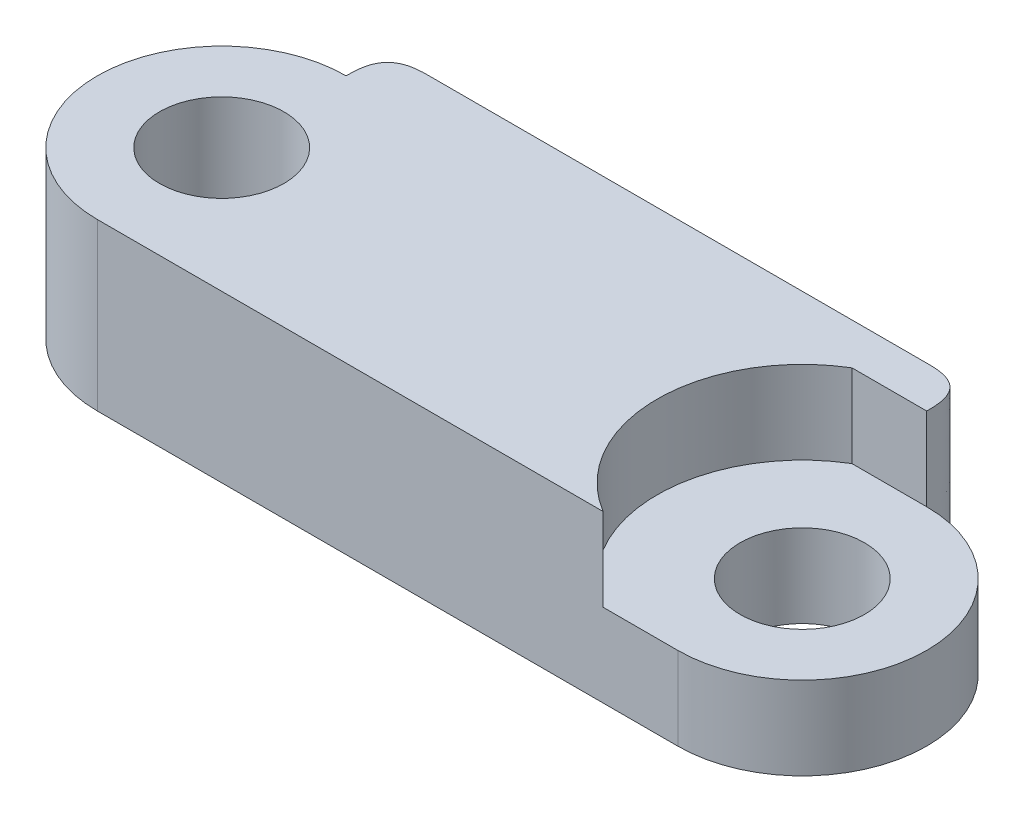
ISO-10303-21;
HEADER;
FILE_DESCRIPTION(('STEP AP214'),'2;1');
FILE_NAME('part.step','',(''),(''),'','','');
FILE_SCHEMA(('AUTOMOTIVE_DESIGN { 1 0 10303 214 1 1 1 1 }'));
ENDSEC;
DATA;
#1=APPLICATION_CONTEXT('core data for automotive mechanical design processes');
#2=APPLICATION_PROTOCOL_DEFINITION('international standard','automotive_design',2000,#1);
#3=PRODUCT_CONTEXT('',#1,'mechanical');
#4=PRODUCT('Part','Part','',(#3));
#5=PRODUCT_RELATED_PRODUCT_CATEGORY('part','',(#4));
#6=PRODUCT_DEFINITION_FORMATION('','',#4);
#7=PRODUCT_DEFINITION_CONTEXT('part definition',#1,'design');
#8=PRODUCT_DEFINITION('design','',#6,#7);
#9=PRODUCT_DEFINITION_SHAPE('','',#8);
#10=(LENGTH_UNIT() NAMED_UNIT(*) SI_UNIT(.MILLI.,.METRE.));
#11=(NAMED_UNIT(*) PLANE_ANGLE_UNIT() SI_UNIT($,.RADIAN.));
#12=(NAMED_UNIT(*) SI_UNIT($,.STERADIAN.) SOLID_ANGLE_UNIT());
#13=UNCERTAINTY_MEASURE_WITH_UNIT(LENGTH_MEASURE(1.E-05),#10,'distance_accuracy_value','');
#14=(GEOMETRIC_REPRESENTATION_CONTEXT(3) GLOBAL_UNCERTAINTY_ASSIGNED_CONTEXT((#13)) GLOBAL_UNIT_ASSIGNED_CONTEXT((#10,
#11,#12)) REPRESENTATION_CONTEXT('',''));
#15=CARTESIAN_POINT('',(0.,0.,0.));
#16=DIRECTION('',(0.,0.,1.));
#17=DIRECTION('',(1.,0.,0.));
#18=AXIS2_PLACEMENT_3D('',#15,#16,#17);
#19=CARTESIAN_POINT('',(-7.,2.,0.));
#20=DIRECTION('',(0.,1.,0.));
#21=DIRECTION('',(0.,0.,1.));
#22=AXIS2_PLACEMENT_3D('',#19,#20,#21);
#23=PLANE('',#22);
#24=DIRECTION('',(-1.,0.,0.));
#25=VECTOR('',#24,1.);
#26=CARTESIAN_POINT('',(-7.,2.,-3.));
#27=LINE('',#26,#25);
#28=CARTESIAN_POINT('',(7.,2.,-3.));
#29=VERTEX_POINT('',#28);
#30=CARTESIAN_POINT('',(5.19722436226801,2.,-3.));
#31=VERTEX_POINT('',#30);
#32=EDGE_CURVE('E202',#29,#31,#27,.T.);
#33=ORIENTED_EDGE('',*,*,#32,.F.);
#34=CARTESIAN_POINT('',(6.,2.,-4.));
#35=CARTESIAN_POINT('',(6.16819805153395,2.,-4.));
#36=CARTESIAN_POINT('',(6.3363961030679,2.,-4.));
#37=CARTESIAN_POINT('',(6.70710678118655,2.,-3.92830808016392));
#38=CARTESIAN_POINT('',(6.92830808016392,2.,-3.70710678118655));
#39=CARTESIAN_POINT('',(7.,2.,-3.33639610306789));
#40=CARTESIAN_POINT('',(7.,2.,-3.16819805153395));
#41=CARTESIAN_POINT('',(7.,2.,-3.));
#42=B_SPLINE_CURVE_WITH_KNOTS('',5,(#34,#35,#36,#37,#38,#39,#40,#41),.UNSPECIFIED.,.F.,.F.,(6,2,
6),(0.,0.5,1.),.UNSPECIFIED.);
#43=CARTESIAN_POINT('',(6.,2.,-4.));
#44=VERTEX_POINT('',#43);
#45=EDGE_CURVE('E11',#29,#44,#42,.F.);
#46=ORIENTED_EDGE('',*,*,#45,.T.);
#47=DIRECTION('',(1.,0.,0.));
#48=VECTOR('',#47,1.);
#49=CARTESIAN_POINT('',(7.,2.,-4.));
#50=LINE('',#49,#48);
#51=CARTESIAN_POINT('',(-6.,2.,-4.));
#52=VERTEX_POINT('',#51);
#53=EDGE_CURVE('E199',#52,#44,#50,.T.);
#54=ORIENTED_EDGE('',*,*,#53,.F.);
#55=CARTESIAN_POINT('',(-7.,2.,-3.));
#56=CARTESIAN_POINT('',(-7.,2.,-3.16819805153395));
#57=CARTESIAN_POINT('',(-7.,2.,-3.33639610306789));
#58=CARTESIAN_POINT('',(-6.92830808016392,2.,-3.70710678118655));
#59=CARTESIAN_POINT('',(-6.70710678118655,2.,-3.92830808016392));
#60=CARTESIAN_POINT('',(-6.3363961030679,2.,-4.));
#61=CARTESIAN_POINT('',(-6.16819805153395,2.,-4.));
#62=CARTESIAN_POINT('',(-6.,2.,-4.));
#63=B_SPLINE_CURVE_WITH_KNOTS('',5,(#55,#56,#57,#58,#59,#60,#61,#62),.UNSPECIFIED.,.F.,.F.,(6,2,
6),(0.,0.5,1.),.UNSPECIFIED.);
#64=CARTESIAN_POINT('',(-7.,2.,-3.));
#65=VERTEX_POINT('',#64);
#66=EDGE_CURVE('E56',#52,#65,#63,.F.);
#67=ORIENTED_EDGE('',*,*,#66,.T.);
#68=CARTESIAN_POINT('',(-7.,2.,0.));
#69=DIRECTION('',(0.,1.,0.));
#70=DIRECTION('',(0.,0.,1.));
#71=AXIS2_PLACEMENT_3D('',#68,#69,#70);
#72=CIRCLE('',#71,3.);
#73=CARTESIAN_POINT('',(-7.,2.,3.));
#74=VERTEX_POINT('',#73);
#75=EDGE_CURVE('E135',#65,#74,#72,.T.);
#76=ORIENTED_EDGE('',*,*,#75,.T.);
#77=DIRECTION('',(1.,0.,0.));
#78=VECTOR('',#77,1.);
#79=CARTESIAN_POINT('',(-7.,2.,3.));
#80=LINE('',#79,#78);
#81=CARTESIAN_POINT('',(5.19722436226801,2.,3.));
#82=VERTEX_POINT('',#81);
#83=EDGE_CURVE('E245',#74,#82,#80,.T.);
#84=ORIENTED_EDGE('',*,*,#83,.T.);
#85=CARTESIAN_POINT('',(7.,2.,0.));
#86=DIRECTION('',(0.,1.,0.));
#87=DIRECTION('',(0.,0.,-1.));
#88=AXIS2_PLACEMENT_3D('',#85,#86,#87);
#89=CIRCLE('',#88,3.5);
#90=EDGE_CURVE('E224',#31,#82,#89,.T.);
#91=ORIENTED_EDGE('',*,*,#90,.F.);
#92=EDGE_LOOP('',(#33,#46,#54,#67,#76,#84,#91));
#93=FACE_BOUND('',#92,.T.);
#94=CARTESIAN_POINT('',(-7.,2.,0.));
#95=DIRECTION('',(0.,1.,0.));
#96=DIRECTION('',(0.,0.,1.));
#97=AXIS2_PLACEMENT_3D('',#94,#95,#96);
#98=CIRCLE('',#97,1.5);
#99=CARTESIAN_POINT('',(-7.,2.,1.5));
#100=VERTEX_POINT('',#99);
#101=EDGE_CURVE('E239',#100,#100,#98,.T.);
#102=ORIENTED_EDGE('',*,*,#101,.F.);
#103=EDGE_LOOP('',(#102));
#104=FACE_BOUND('',#103,.T.);
#105=ADVANCED_FACE('F41',(#93,#104),#23,.T.);
#106=CARTESIAN_POINT('',(-7.,-2.,0.));
#107=DIRECTION('',(0.,1.,0.));
#108=DIRECTION('',(0.,0.,1.));
#109=AXIS2_PLACEMENT_3D('',#106,#107,#108);
#110=PLANE('',#109);
#111=DIRECTION('',(1.,0.,0.));
#112=VECTOR('',#111,1.);
#113=CARTESIAN_POINT('',(7.,-2.,-4.));
#114=LINE('',#113,#112);
#115=CARTESIAN_POINT('',(-6.,-2.,-4.));
#116=VERTEX_POINT('',#115);
#117=CARTESIAN_POINT('',(6.,-2.,-4.));
#118=VERTEX_POINT('',#117);
#119=EDGE_CURVE('E122',#116,#118,#114,.T.);
#120=ORIENTED_EDGE('',*,*,#119,.T.);
#121=CARTESIAN_POINT('',(7.,-2.,-3.));
#122=CARTESIAN_POINT('',(7.,-2.,-3.16819805153395));
#123=CARTESIAN_POINT('',(7.,-2.,-3.33639610306789));
#124=CARTESIAN_POINT('',(6.92830808016392,-2.,-3.70710678118655));
#125=CARTESIAN_POINT('',(6.70710678118655,-2.,-3.92830808016392));
#126=CARTESIAN_POINT('',(6.3363961030679,-2.,-4.));
#127=CARTESIAN_POINT('',(6.16819805153395,-2.,-4.));
#128=CARTESIAN_POINT('',(6.,-2.,-4.));
#129=B_SPLINE_CURVE_WITH_KNOTS('',5,(#121,#122,#123,#124,#125,#126,#127,#128),.UNSPECIFIED.,.F.,
.F.,(6,2,6),(0.,0.5,1.),.UNSPECIFIED.);
#130=CARTESIAN_POINT('',(7.,-2.,-3.));
#131=VERTEX_POINT('',#130);
#132=EDGE_CURVE('E63',#118,#131,#129,.F.);
#133=ORIENTED_EDGE('',*,*,#132,.T.);
#134=CARTESIAN_POINT('',(7.,-2.,0.));
#135=DIRECTION('',(0.,1.,0.));
#136=DIRECTION('',(0.,0.,1.));
#137=AXIS2_PLACEMENT_3D('',#134,#135,#136);
#138=CIRCLE('',#137,3.);
#139=CARTESIAN_POINT('',(7.,-2.,3.));
#140=VERTEX_POINT('',#139);
#141=EDGE_CURVE('E121',#140,#131,#138,.T.);
#142=ORIENTED_EDGE('',*,*,#141,.F.);
#143=DIRECTION('',(1.,0.,0.));
#144=VECTOR('',#143,1.);
#145=CARTESIAN_POINT('',(-7.,-2.,3.));
#146=LINE('',#145,#144);
#147=CARTESIAN_POINT('',(-7.,-2.,3.));
#148=VERTEX_POINT('',#147);
#149=EDGE_CURVE('E136',#148,#140,#146,.T.);
#150=ORIENTED_EDGE('',*,*,#149,.F.);
#151=CARTESIAN_POINT('',(-7.,-2.,0.));
#152=DIRECTION('',(0.,1.,0.));
#153=DIRECTION('',(0.,0.,1.));
#154=AXIS2_PLACEMENT_3D('',#151,#152,#153);
#155=CIRCLE('',#154,3.);
#156=CARTESIAN_POINT('',(-7.,-2.,-3.));
#157=VERTEX_POINT('',#156);
#158=EDGE_CURVE('E242',#157,#148,#155,.T.);
#159=ORIENTED_EDGE('',*,*,#158,.F.);
#160=CARTESIAN_POINT('',(-6.,-2.,-4.));
#161=CARTESIAN_POINT('',(-6.16819805153395,-2.,-4.));
#162=CARTESIAN_POINT('',(-6.3363961030679,-2.,-4.));
#163=CARTESIAN_POINT('',(-6.70710678118655,-2.,-3.92830808016392));
#164=CARTESIAN_POINT('',(-6.92830808016392,-2.,-3.70710678118655));
#165=CARTESIAN_POINT('',(-7.,-2.,-3.33639610306789));
#166=CARTESIAN_POINT('',(-7.,-2.,-3.16819805153395));
#167=CARTESIAN_POINT('',(-7.,-2.,-3.));
#168=B_SPLINE_CURVE_WITH_KNOTS('',5,(#160,#161,#162,#163,#164,#165,#166,#167),.UNSPECIFIED.,.F.,
.F.,(6,2,6),(0.,0.5,1.),.UNSPECIFIED.);
#169=EDGE_CURVE('E72',#157,#116,#168,.F.);
#170=ORIENTED_EDGE('',*,*,#169,.T.);
#171=EDGE_LOOP('',(#120,#133,#142,#150,#159,#170));
#172=FACE_BOUND('',#171,.T.);
#173=CARTESIAN_POINT('',(-7.,-2.,0.));
#174=DIRECTION('',(0.,1.,0.));
#175=DIRECTION('',(0.,0.,1.));
#176=AXIS2_PLACEMENT_3D('',#173,#174,#175);
#177=CIRCLE('',#176,1.5);
#178=CARTESIAN_POINT('',(-7.,-2.,1.5));
#179=VERTEX_POINT('',#178);
#180=EDGE_CURVE('E238',#179,#179,#177,.T.);
#181=ORIENTED_EDGE('',*,*,#180,.T.);
#182=EDGE_LOOP('',(#181));
#183=FACE_BOUND('',#182,.T.);
#184=CARTESIAN_POINT('',(7.,-2.,0.));
#185=DIRECTION('',(0.,1.,0.));
#186=DIRECTION('',(0.,0.,1.));
#187=AXIS2_PLACEMENT_3D('',#184,#185,#186);
#188=CIRCLE('',#187,1.5);
#189=CARTESIAN_POINT('',(7.,-2.,1.5));
#190=VERTEX_POINT('',#189);
#191=EDGE_CURVE('E235',#190,#190,#188,.T.);
#192=ORIENTED_EDGE('',*,*,#191,.T.);
#193=EDGE_LOOP('',(#192));
#194=FACE_BOUND('',#193,.T.);
#195=ADVANCED_FACE('F119',(#172,#183,#194),#110,.F.);
#196=CARTESIAN_POINT('',(-7.,2.,0.));
#197=DIRECTION('',(0.,-1.,0.));
#198=DIRECTION('',(0.,0.,-1.));
#199=AXIS2_PLACEMENT_3D('',#196,#197,#198);
#200=CYLINDRICAL_SURFACE('',#199,3.);
#201=ORIENTED_EDGE('',*,*,#158,.T.);
#202=DIRECTION('',(0.,-1.,0.));
#203=VECTOR('',#202,1.);
#204=CARTESIAN_POINT('',(-7.,2.,3.));
#205=LINE('',#204,#203);
#206=EDGE_CURVE('E249',#74,#148,#205,.T.);
#207=ORIENTED_EDGE('',*,*,#206,.F.);
#208=ORIENTED_EDGE('',*,*,#75,.F.);
#209=CARTESIAN_POINT('',(-7.,-2.2,-3.));
#210=CARTESIAN_POINT('',(-7.,-0.733333333333336,-3.));
#211=CARTESIAN_POINT('',(-7.,0.733333333333336,-3.));
#212=CARTESIAN_POINT('',(-7.,2.2,-3.));
#213=B_SPLINE_CURVE_WITH_KNOTS('',3,(#209,#210,#211,#212),.UNSPECIFIED.,.F.,.F.,(4,4),
(0.0138356688476182,0.0182356688476182),.UNSPECIFIED.);
#214=EDGE_CURVE('E144',#65,#157,#213,.F.);
#215=ORIENTED_EDGE('',*,*,#214,.T.);
#216=EDGE_LOOP('',(#201,#207,#208,#215));
#217=FACE_BOUND('',#216,.T.);
#218=ADVANCED_FACE('F165',(#217),#200,.T.);
#219=CARTESIAN_POINT('',(-7.,2.,3.));
#220=DIRECTION('',(0.,0.,-1.));
#221=DIRECTION('',(-1.,0.,0.));
#222=AXIS2_PLACEMENT_3D('',#219,#220,#221);
#223=PLANE('',#222);
#224=DIRECTION('',(1.,0.,0.));
#225=VECTOR('',#224,1.);
#226=CARTESIAN_POINT('',(7.,0.,3.));
#227=LINE('',#226,#225);
#228=CARTESIAN_POINT('',(5.19722436226801,0.,3.));
#229=VERTEX_POINT('',#228);
#230=CARTESIAN_POINT('',(7.,0.,3.));
#231=VERTEX_POINT('',#230);
#232=EDGE_CURVE('E223',#229,#231,#227,.T.);
#233=ORIENTED_EDGE('',*,*,#232,.F.);
#234=DIRECTION('',(0.,1.,0.));
#235=VECTOR('',#234,1.);
#236=CARTESIAN_POINT('',(5.19722436226801,0.,3.));
#237=LINE('',#236,#235);
#238=EDGE_CURVE('E231',#229,#82,#237,.T.);
#239=ORIENTED_EDGE('',*,*,#238,.T.);
#240=ORIENTED_EDGE('',*,*,#83,.F.);
#241=ORIENTED_EDGE('',*,*,#206,.T.);
#242=ORIENTED_EDGE('',*,*,#149,.T.);
#243=DIRECTION('',(0.,-1.,0.));
#244=VECTOR('',#243,1.);
#245=CARTESIAN_POINT('',(7.,2.,3.));
#246=LINE('',#245,#244);
#247=EDGE_CURVE('E133',#231,#140,#246,.T.);
#248=ORIENTED_EDGE('',*,*,#247,.F.);
#249=EDGE_LOOP('',(#233,#239,#240,#241,#242,#248));
#250=FACE_BOUND('',#249,.T.);
#251=ADVANCED_FACE('F255',(#250),#223,.F.);
#252=CARTESIAN_POINT('',(7.,2.,0.));
#253=DIRECTION('',(0.,-1.,0.));
#254=DIRECTION('',(0.,0.,-1.));
#255=AXIS2_PLACEMENT_3D('',#252,#253,#254);
#256=CYLINDRICAL_SURFACE('',#255,3.);
#257=CARTESIAN_POINT('',(7.,2.2,-3.));
#258=CARTESIAN_POINT('',(7.,0.733333333333334,-3.));
#259=CARTESIAN_POINT('',(7.,-0.73333333333334,-3.));
#260=CARTESIAN_POINT('',(7.,-2.20000000000001,-3.));
#261=B_SPLINE_CURVE_WITH_KNOTS('',3,(#257,#258,#259,#260),.UNSPECIFIED.,.F.,.F.,(4,4),
(0.0138356688476182,0.0182356688476182),.UNSPECIFIED.);
#262=CARTESIAN_POINT('',(7.,0.,-3.));
#263=VERTEX_POINT('',#262);
#264=EDGE_CURVE('E129',#263,#131,#261,.T.);
#265=ORIENTED_EDGE('',*,*,#264,.F.);
#266=CARTESIAN_POINT('',(7.,0.,0.));
#267=DIRECTION('',(0.,1.,0.));
#268=DIRECTION('',(0.,0.,-1.));
#269=AXIS2_PLACEMENT_3D('',#266,#267,#268);
#270=CIRCLE('',#269,3.);
#271=EDGE_CURVE('E226',#231,#263,#270,.T.);
#272=ORIENTED_EDGE('',*,*,#271,.F.);
#273=ORIENTED_EDGE('',*,*,#247,.T.);
#274=ORIENTED_EDGE('',*,*,#141,.T.);
#275=EDGE_LOOP('',(#265,#272,#273,#274));
#276=FACE_BOUND('',#275,.T.);
#277=ADVANCED_FACE('F127',(#276),#256,.T.);
#278=CARTESIAN_POINT('',(-7.,2.,0.));
#279=DIRECTION('',(0.,-1.,0.));
#280=DIRECTION('',(0.,0.,-1.));
#281=AXIS2_PLACEMENT_3D('',#278,#279,#280);
#282=CYLINDRICAL_SURFACE('',#281,1.5);
#283=ORIENTED_EDGE('',*,*,#101,.T.);
#284=EDGE_LOOP('',(#283));
#285=FACE_BOUND('',#284,.T.);
#286=ORIENTED_EDGE('',*,*,#180,.F.);
#287=EDGE_LOOP('',(#286));
#288=FACE_BOUND('',#287,.T.);
#289=ADVANCED_FACE('F383',(#285,#288),#282,.F.);
#290=CARTESIAN_POINT('',(7.,2.,0.));
#291=DIRECTION('',(0.,-1.,0.));
#292=DIRECTION('',(0.,0.,-1.));
#293=AXIS2_PLACEMENT_3D('',#290,#291,#292);
#294=CYLINDRICAL_SURFACE('',#293,1.5);
#295=CARTESIAN_POINT('',(7.,0.,0.));
#296=DIRECTION('',(0.,-1.,0.));
#297=DIRECTION('',(0.,0.,-1.));
#298=AXIS2_PLACEMENT_3D('',#295,#296,#297);
#299=CIRCLE('',#298,1.5);
#300=CARTESIAN_POINT('',(7.,0.,-1.5));
#301=VERTEX_POINT('',#300);
#302=EDGE_CURVE('E214',#301,#301,#299,.T.);
#303=ORIENTED_EDGE('',*,*,#302,.F.);
#304=EDGE_LOOP('',(#303));
#305=FACE_BOUND('',#304,.T.);
#306=ORIENTED_EDGE('',*,*,#191,.F.);
#307=EDGE_LOOP('',(#306));
#308=FACE_BOUND('',#307,.T.);
#309=ADVANCED_FACE('F380',(#305,#308),#294,.F.);
#310=CARTESIAN_POINT('',(7.,0.,0.));
#311=DIRECTION('',(0.,1.,0.));
#312=DIRECTION('',(0.,0.,1.));
#313=AXIS2_PLACEMENT_3D('',#310,#311,#312);
#314=CYLINDRICAL_SURFACE('',#313,3.5);
#315=ORIENTED_EDGE('',*,*,#90,.T.);
#316=ORIENTED_EDGE('',*,*,#238,.F.);
#317=CARTESIAN_POINT('',(7.,0.,0.));
#318=DIRECTION('',(0.,1.,0.));
#319=DIRECTION('',(0.,0.,-1.));
#320=AXIS2_PLACEMENT_3D('',#317,#318,#319);
#321=CIRCLE('',#320,3.5);
#322=CARTESIAN_POINT('',(5.19722436226801,0.,-3.));
#323=VERTEX_POINT('',#322);
#324=EDGE_CURVE('E220',#323,#229,#321,.T.);
#325=ORIENTED_EDGE('',*,*,#324,.F.);
#326=DIRECTION('',(0.,1.,0.));
#327=VECTOR('',#326,1.);
#328=CARTESIAN_POINT('',(5.19722436226801,0.,-3.));
#329=LINE('',#328,#327);
#330=EDGE_CURVE('E228',#323,#31,#329,.T.);
#331=ORIENTED_EDGE('',*,*,#330,.T.);
#332=EDGE_LOOP('',(#315,#316,#325,#331));
#333=FACE_BOUND('',#332,.T.);
#334=ADVANCED_FACE('F376',(#333),#314,.F.);
#335=CARTESIAN_POINT('',(7.,0.,0.));
#336=DIRECTION('',(0.,-1.,0.));
#337=DIRECTION('',(0.,0.,-1.));
#338=AXIS2_PLACEMENT_3D('',#335,#336,#337);
#339=PLANE('',#338);
#340=ORIENTED_EDGE('',*,*,#302,.T.);
#341=EDGE_LOOP('',(#340));
#342=FACE_BOUND('',#341,.T.);
#343=ORIENTED_EDGE('',*,*,#324,.T.);
#344=ORIENTED_EDGE('',*,*,#232,.T.);
#345=ORIENTED_EDGE('',*,*,#271,.T.);
#346=DIRECTION('',(-1.,0.,0.));
#347=VECTOR('',#346,1.);
#348=CARTESIAN_POINT('',(5.19722436226801,0.,-3.));
#349=LINE('',#348,#347);
#350=EDGE_CURVE('E234',#263,#323,#349,.T.);
#351=ORIENTED_EDGE('',*,*,#350,.T.);
#352=EDGE_LOOP('',(#343,#344,#345,#351));
#353=FACE_BOUND('',#352,.T.);
#354=ADVANCED_FACE('F353',(#342,#353),#339,.F.);
#355=CARTESIAN_POINT('',(-7.,16.0356688476182,-3.));
#356=DIRECTION('',(0.,0.,1.));
#357=DIRECTION('',(1.,0.,0.));
#358=AXIS2_PLACEMENT_3D('',#355,#356,#357);
#359=PLANE('',#358);
#360=ORIENTED_EDGE('',*,*,#330,.F.);
#361=ORIENTED_EDGE('',*,*,#350,.F.);
#362=CARTESIAN_POINT('',(7.,2.2,-3.));
#363=CARTESIAN_POINT('',(7.,0.733333333333334,-3.));
#364=CARTESIAN_POINT('',(7.,-0.73333333333334,-3.));
#365=CARTESIAN_POINT('',(7.,-2.20000000000001,-3.));
#366=B_SPLINE_CURVE_WITH_KNOTS('',3,(#362,#363,#364,#365),.UNSPECIFIED.,.F.,.F.,(4,4),
(0.0138356688476182,0.0182356688476182),.UNSPECIFIED.);
#367=EDGE_CURVE('E142',#29,#263,#366,.T.);
#368=ORIENTED_EDGE('',*,*,#367,.F.);
#369=ORIENTED_EDGE('',*,*,#32,.T.);
#370=EDGE_LOOP('',(#360,#361,#368,#369));
#371=FACE_BOUND('',#370,.T.);
#372=ADVANCED_FACE('F344',(#371),#359,.T.);
#373=CARTESIAN_POINT('',(7.,16.0356688476182,-4.));
#374=DIRECTION('',(0.,0.,-1.));
#375=DIRECTION('',(-1.,0.,0.));
#376=AXIS2_PLACEMENT_3D('',#373,#374,#375);
#377=PLANE('',#376);
#378=ORIENTED_EDGE('',*,*,#53,.T.);
#379=CARTESIAN_POINT('',(6.,-2.20000000000001,-4.));
#380=CARTESIAN_POINT('',(6.,-0.73333333333334,-4.));
#381=CARTESIAN_POINT('',(6.,0.733333333333334,-4.));
#382=CARTESIAN_POINT('',(6.,2.2,-4.));
#383=B_SPLINE_CURVE_WITH_KNOTS('',3,(#379,#380,#381,#382),.UNSPECIFIED.,.F.,.F.,(4,4),
(0.0138356688476182,0.0182356688476182),.UNSPECIFIED.);
#384=EDGE_CURVE('E193',#44,#118,#383,.F.);
#385=ORIENTED_EDGE('',*,*,#384,.T.);
#386=ORIENTED_EDGE('',*,*,#119,.F.);
#387=CARTESIAN_POINT('',(-6.,2.2,-4.));
#388=CARTESIAN_POINT('',(-6.,0.733333333333336,-4.));
#389=CARTESIAN_POINT('',(-6.,-0.733333333333336,-4.));
#390=CARTESIAN_POINT('',(-6.,-2.2,-4.));
#391=B_SPLINE_CURVE_WITH_KNOTS('',3,(#387,#388,#389,#390),.UNSPECIFIED.,.F.,.F.,(4,4),
(0.0138356688476182,0.0182356688476182),.UNSPECIFIED.);
#392=EDGE_CURVE('E208',#116,#52,#391,.F.);
#393=ORIENTED_EDGE('',*,*,#392,.T.);
#394=EDGE_LOOP('',(#378,#385,#386,#393));
#395=FACE_BOUND('',#394,.T.);
#396=ADVANCED_FACE('F164',(#395),#377,.T.);
#397=CARTESIAN_POINT('',(6.,2.2,-4.));
#398=CARTESIAN_POINT('',(6.,0.733333333333334,-4.));
#399=CARTESIAN_POINT('',(6.,-0.73333333333334,-4.));
#400=CARTESIAN_POINT('',(6.,-2.20000000000001,-4.));
#401=CARTESIAN_POINT('',(6.16819805153395,2.2,-4.));
#402=CARTESIAN_POINT('',(6.16819805153395,0.733333333333334,-4.));
#403=CARTESIAN_POINT('',(6.16819805153395,-0.73333333333334,-4.));
#404=CARTESIAN_POINT('',(6.16819805153395,-2.20000000000001,-4.));
#405=CARTESIAN_POINT('',(6.3363961030679,2.2,-4.));
#406=CARTESIAN_POINT('',(6.33639610306789,0.733333333333334,-4.));
#407=CARTESIAN_POINT('',(6.33639610306789,-0.73333333333334,-4.));
#408=CARTESIAN_POINT('',(6.3363961030679,-2.20000000000001,-4.));
#409=CARTESIAN_POINT('',(6.70710678118655,2.2,-3.92830808016392));
#410=CARTESIAN_POINT('',(6.70710678118655,0.733333333333334,-3.92830808016392));
#411=CARTESIAN_POINT('',(6.70710678118655,-0.73333333333334,-3.92830808016392));
#412=CARTESIAN_POINT('',(6.70710678118655,-2.20000000000001,-3.92830808016392));
#413=CARTESIAN_POINT('',(6.92830808016392,2.2,-3.70710678118655));
#414=CARTESIAN_POINT('',(6.92830808016392,0.733333333333334,-3.70710678118655));
#415=CARTESIAN_POINT('',(6.92830808016392,-0.73333333333334,-3.70710678118655));
#416=CARTESIAN_POINT('',(6.92830808016392,-2.20000000000001,-3.70710678118655));
#417=CARTESIAN_POINT('',(7.,2.2,-3.33639610306789));
#418=CARTESIAN_POINT('',(7.,0.733333333333334,-3.33639610306789));
#419=CARTESIAN_POINT('',(7.,-0.73333333333334,-3.33639610306789));
#420=CARTESIAN_POINT('',(7.,-2.20000000000001,-3.33639610306789));
#421=CARTESIAN_POINT('',(7.,2.2,-3.16819805153395));
#422=CARTESIAN_POINT('',(7.,0.733333333333334,-3.16819805153394));
#423=CARTESIAN_POINT('',(7.,-0.73333333333334,-3.16819805153394));
#424=CARTESIAN_POINT('',(7.,-2.20000000000001,-3.16819805153395));
#425=CARTESIAN_POINT('',(7.,2.2,-3.));
#426=CARTESIAN_POINT('',(7.,0.733333333333334,-3.));
#427=CARTESIAN_POINT('',(7.,-0.73333333333334,-3.));
#428=CARTESIAN_POINT('',(7.,-2.20000000000001,-3.));
#429=B_SPLINE_SURFACE_WITH_KNOTS('',5,3,((#397,#398,#399,#400),(#401,#402,#403,#404),(#405,#406,
#407,#408),(#409,#410,#411,#412),(#413,#414,#415,#416),(#417,#418,#419,#420),(#421,#422,#423,
#424),(#425,#426,#427,#428)),.UNSPECIFIED.,.F.,.F.,.F.,(6,2,6),(4,4),(0.,0.5,1.),
(0.0138356688476182,0.0182356688476182),.UNSPECIFIED.);
#430=ORIENTED_EDGE('',*,*,#367,.T.);
#431=ORIENTED_EDGE('',*,*,#264,.T.);
#432=ORIENTED_EDGE('',*,*,#132,.F.);
#433=ORIENTED_EDGE('',*,*,#384,.F.);
#434=ORIENTED_EDGE('',*,*,#45,.F.);
#435=EDGE_LOOP('',(#430,#431,#432,#433,#434));
#436=FACE_BOUND('',#435,.T.);
#437=ADVANCED_FACE('F139',(#436),#429,.T.);
#438=CARTESIAN_POINT('',(-7.,2.2,-3.));
#439=CARTESIAN_POINT('',(-7.,0.733333333333336,-3.));
#440=CARTESIAN_POINT('',(-7.,-0.733333333333336,-3.));
#441=CARTESIAN_POINT('',(-7.,-2.2,-3.));
#442=CARTESIAN_POINT('',(-7.,2.2,-3.16819805153395));
#443=CARTESIAN_POINT('',(-7.,0.733333333333336,-3.16819805153395));
#444=CARTESIAN_POINT('',(-7.,-0.733333333333336,-3.16819805153395));
#445=CARTESIAN_POINT('',(-7.,-2.2,-3.16819805153395));
#446=CARTESIAN_POINT('',(-7.,2.2,-3.33639610306789));
#447=CARTESIAN_POINT('',(-7.,0.733333333333336,-3.33639610306789));
#448=CARTESIAN_POINT('',(-7.,-0.733333333333336,-3.33639610306789));
#449=CARTESIAN_POINT('',(-7.,-2.2,-3.33639610306789));
#450=CARTESIAN_POINT('',(-6.92830808016392,2.2,-3.70710678118655));
#451=CARTESIAN_POINT('',(-6.92830808016392,0.733333333333336,-3.70710678118655));
#452=CARTESIAN_POINT('',(-6.92830808016392,-0.733333333333336,-3.70710678118655));
#453=CARTESIAN_POINT('',(-6.92830808016392,-2.2,-3.70710678118655));
#454=CARTESIAN_POINT('',(-6.70710678118655,2.2,-3.92830808016392));
#455=CARTESIAN_POINT('',(-6.70710678118655,0.733333333333336,-3.92830808016392));
#456=CARTESIAN_POINT('',(-6.70710678118655,-0.733333333333336,-3.92830808016392));
#457=CARTESIAN_POINT('',(-6.70710678118655,-2.2,-3.92830808016392));
#458=CARTESIAN_POINT('',(-6.3363961030679,2.2,-4.));
#459=CARTESIAN_POINT('',(-6.33639610306789,0.733333333333336,-4.));
#460=CARTESIAN_POINT('',(-6.33639610306789,-0.733333333333336,-4.));
#461=CARTESIAN_POINT('',(-6.3363961030679,-2.2,-4.));
#462=CARTESIAN_POINT('',(-6.16819805153395,2.2,-4.));
#463=CARTESIAN_POINT('',(-6.16819805153395,0.733333333333336,-4.));
#464=CARTESIAN_POINT('',(-6.16819805153395,-0.733333333333336,-4.));
#465=CARTESIAN_POINT('',(-6.16819805153395,-2.2,-4.));
#466=CARTESIAN_POINT('',(-6.,2.2,-4.));
#467=CARTESIAN_POINT('',(-6.,0.733333333333336,-4.));
#468=CARTESIAN_POINT('',(-6.,-0.733333333333336,-4.));
#469=CARTESIAN_POINT('',(-6.,-2.2,-4.));
#470=B_SPLINE_SURFACE_WITH_KNOTS('',5,3,((#438,#439,#440,#441),(#442,#443,#444,#445),(#446,#447,
#448,#449),(#450,#451,#452,#453),(#454,#455,#456,#457),(#458,#459,#460,#461),(#462,#463,#464,
#465),(#466,#467,#468,#469)),.UNSPECIFIED.,.F.,.F.,.F.,(6,2,6),(4,4),(0.,0.5,1.),
(0.0138356688476182,0.0182356688476182),.UNSPECIFIED.);
#471=ORIENTED_EDGE('',*,*,#66,.F.);
#472=ORIENTED_EDGE('',*,*,#392,.F.);
#473=ORIENTED_EDGE('',*,*,#169,.F.);
#474=ORIENTED_EDGE('',*,*,#214,.F.);
#475=EDGE_LOOP('',(#471,#472,#473,#474));
#476=FACE_BOUND('',#475,.T.);
#477=ADVANCED_FACE('F44',(#476),#470,.T.);
#478=CLOSED_SHELL('',(#105,#195,#218,#251,#277,#289,#309,#334,#354,#372,#396,#437,#477));
#479=MANIFOLD_SOLID_BREP('B2',#478);
#480=ADVANCED_BREP_SHAPE_REPRESENTATION('',(#18,#479),#14);
#481=SHAPE_DEFINITION_REPRESENTATION(#9,#480);
ENDSEC;
END-ISO-10303-21;
